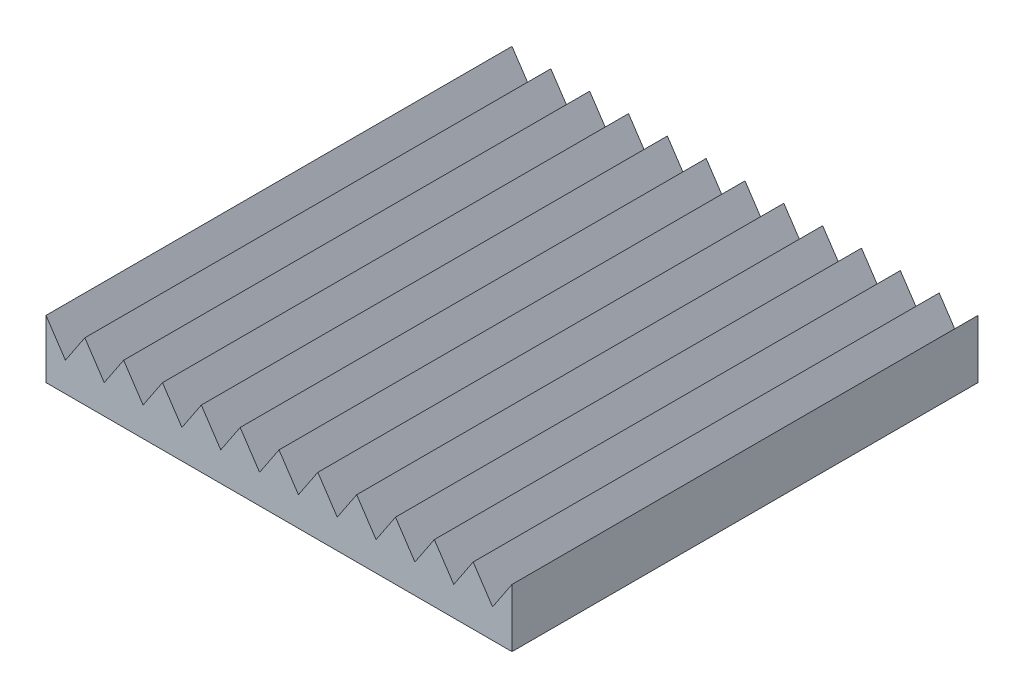
ISO-10303-21;
HEADER;
FILE_DESCRIPTION(('STEP AP214'),'2;1');
FILE_NAME('part.step','',(''),(''),'','','');
FILE_SCHEMA(('AUTOMOTIVE_DESIGN { 1 0 10303 214 1 1 1 1 }'));
ENDSEC;
DATA;
#1=APPLICATION_CONTEXT('core data for automotive mechanical design processes');
#2=APPLICATION_PROTOCOL_DEFINITION('international standard','automotive_design',2000,#1);
#3=PRODUCT_CONTEXT('',#1,'mechanical');
#4=PRODUCT('Part','Part','',(#3));
#5=PRODUCT_RELATED_PRODUCT_CATEGORY('part','',(#4));
#6=PRODUCT_DEFINITION_FORMATION('','',#4);
#7=PRODUCT_DEFINITION_CONTEXT('part definition',#1,'design');
#8=PRODUCT_DEFINITION('design','',#6,#7);
#9=PRODUCT_DEFINITION_SHAPE('','',#8);
#10=(LENGTH_UNIT() NAMED_UNIT(*) SI_UNIT(.MILLI.,.METRE.));
#11=(NAMED_UNIT(*) PLANE_ANGLE_UNIT() SI_UNIT($,.RADIAN.));
#12=(NAMED_UNIT(*) SI_UNIT($,.STERADIAN.) SOLID_ANGLE_UNIT());
#13=UNCERTAINTY_MEASURE_WITH_UNIT(LENGTH_MEASURE(1.E-05),#10,'distance_accuracy_value','');
#14=(GEOMETRIC_REPRESENTATION_CONTEXT(3) GLOBAL_UNCERTAINTY_ASSIGNED_CONTEXT((#13)) GLOBAL_UNIT_ASSIGNED_CONTEXT((#10,
#11,#12)) REPRESENTATION_CONTEXT('',''));
#15=CARTESIAN_POINT('',(0.,0.,0.));
#16=DIRECTION('',(0.,0.,1.));
#17=DIRECTION('',(1.,0.,0.));
#18=AXIS2_PLACEMENT_3D('',#15,#16,#17);
#19=CARTESIAN_POINT('',(0.,38.1,0.));
#20=DIRECTION('',(1.,0.,0.));
#21=DIRECTION('',(0.,0.,-1.));
#22=AXIS2_PLACEMENT_3D('',#19,#20,#21);
#23=PLANE('',#22);
#24=DIRECTION('',(0.,0.,1.));
#25=VECTOR('',#24,1.);
#26=CARTESIAN_POINT('',(0.,0.,0.));
#27=LINE('',#26,#25);
#28=CARTESIAN_POINT('',(0.,0.,0.));
#29=VERTEX_POINT('',#28);
#30=CARTESIAN_POINT('',(0.,0.,304.8));
#31=VERTEX_POINT('',#30);
#32=EDGE_CURVE('E92',#29,#31,#27,.T.);
#33=ORIENTED_EDGE('',*,*,#32,.T.);
#34=DIRECTION('',(0.,-1.,0.));
#35=VECTOR('',#34,1.);
#36=CARTESIAN_POINT('',(0.,38.1,304.8));
#37=LINE('',#36,#35);
#38=CARTESIAN_POINT('',(0.,38.1,304.8));
#39=VERTEX_POINT('',#38);
#40=EDGE_CURVE('E11',#39,#31,#37,.T.);
#41=ORIENTED_EDGE('',*,*,#40,.F.);
#42=DIRECTION('',(0.,0.,1.));
#43=VECTOR('',#42,1.);
#44=CARTESIAN_POINT('',(0.,38.1,0.));
#45=LINE('',#44,#43);
#46=CARTESIAN_POINT('',(0.,38.1,0.));
#47=VERTEX_POINT('',#46);
#48=EDGE_CURVE('E93',#47,#39,#45,.T.);
#49=ORIENTED_EDGE('',*,*,#48,.F.);
#50=DIRECTION('',(0.,-1.,0.));
#51=VECTOR('',#50,1.);
#52=CARTESIAN_POINT('',(0.,38.1,0.));
#53=LINE('',#52,#51);
#54=EDGE_CURVE('E87',#47,#29,#53,.T.);
#55=ORIENTED_EDGE('',*,*,#54,.T.);
#56=EDGE_LOOP('',(#33,#41,#49,#55));
#57=FACE_BOUND('',#56,.T.);
#58=ADVANCED_FACE('F33',(#57),#23,.F.);
#59=CARTESIAN_POINT('',(0.,38.1,304.8));
#60=DIRECTION('',(0.,0.,-1.));
#61=DIRECTION('',(-1.,0.,0.));
#62=AXIS2_PLACEMENT_3D('',#59,#60,#61);
#63=PLANE('',#62);
#64=DIRECTION('',(0.554700196225229,-0.832050294337844,0.));
#65=VECTOR('',#64,1.);
#66=CARTESIAN_POINT('',(279.4,38.1,304.8));
#67=LINE('',#66,#65);
#68=CARTESIAN_POINT('',(279.4,38.1,304.8));
#69=VERTEX_POINT('',#68);
#70=CARTESIAN_POINT('',(292.1,19.05,304.8));
#71=VERTEX_POINT('',#70);
#72=EDGE_CURVE('E254',#69,#71,#67,.T.);
#73=ORIENTED_EDGE('',*,*,#72,.F.);
#74=DIRECTION('',(0.554700196225229,0.832050294337844,0.));
#75=VECTOR('',#74,1.);
#76=CARTESIAN_POINT('',(266.7,19.05,304.8));
#77=LINE('',#76,#75);
#78=CARTESIAN_POINT('',(266.7,19.05,304.8));
#79=VERTEX_POINT('',#78);
#80=EDGE_CURVE('E234',#79,#69,#77,.T.);
#81=ORIENTED_EDGE('',*,*,#80,.F.);
#82=DIRECTION('',(0.554700196225229,-0.832050294337844,0.));
#83=VECTOR('',#82,1.);
#84=CARTESIAN_POINT('',(254.,38.1,304.8));
#85=LINE('',#84,#83);
#86=CARTESIAN_POINT('',(254.,38.1,304.8));
#87=VERTEX_POINT('',#86);
#88=EDGE_CURVE('E248',#87,#79,#85,.T.);
#89=ORIENTED_EDGE('',*,*,#88,.F.);
#90=DIRECTION('',(0.554700196225229,0.832050294337844,0.));
#91=VECTOR('',#90,1.);
#92=CARTESIAN_POINT('',(241.3,19.05,304.8));
#93=LINE('',#92,#91);
#94=CARTESIAN_POINT('',(241.3,19.05,304.8));
#95=VERTEX_POINT('',#94);
#96=EDGE_CURVE('E370',#95,#87,#93,.T.);
#97=ORIENTED_EDGE('',*,*,#96,.F.);
#98=DIRECTION('',(0.554700196225229,-0.832050294337844,0.));
#99=VECTOR('',#98,1.);
#100=CARTESIAN_POINT('',(228.6,38.1,304.8));
#101=LINE('',#100,#99);
#102=CARTESIAN_POINT('',(228.6,38.1,304.8));
#103=VERTEX_POINT('',#102);
#104=EDGE_CURVE('E271',#103,#95,#101,.T.);
#105=ORIENTED_EDGE('',*,*,#104,.F.);
#106=DIRECTION('',(0.554700196225229,0.832050294337844,0.));
#107=VECTOR('',#106,1.);
#108=CARTESIAN_POINT('',(215.9,19.05,304.8));
#109=LINE('',#108,#107);
#110=CARTESIAN_POINT('',(215.9,19.05,304.8));
#111=VERTEX_POINT('',#110);
#112=EDGE_CURVE('E568',#111,#103,#109,.T.);
#113=ORIENTED_EDGE('',*,*,#112,.F.);
#114=DIRECTION('',(0.554700196225229,-0.832050294337844,0.));
#115=VECTOR('',#114,1.);
#116=CARTESIAN_POINT('',(203.2,38.1,304.8));
#117=LINE('',#116,#115);
#118=CARTESIAN_POINT('',(203.2,38.1,304.8));
#119=VERTEX_POINT('',#118);
#120=EDGE_CURVE('E256',#119,#111,#117,.T.);
#121=ORIENTED_EDGE('',*,*,#120,.F.);
#122=DIRECTION('',(0.554700196225229,0.832050294337844,0.));
#123=VECTOR('',#122,1.);
#124=CARTESIAN_POINT('',(190.5,19.05,304.8));
#125=LINE('',#124,#123);
#126=CARTESIAN_POINT('',(190.5,19.05,304.8));
#127=VERTEX_POINT('',#126);
#128=EDGE_CURVE('E352',#127,#119,#125,.T.);
#129=ORIENTED_EDGE('',*,*,#128,.F.);
#130=DIRECTION('',(0.554700196225229,-0.832050294337844,0.));
#131=VECTOR('',#130,1.);
#132=CARTESIAN_POINT('',(177.8,38.1,304.8));
#133=LINE('',#132,#131);
#134=CARTESIAN_POINT('',(177.8,38.1,304.8));
#135=VERTEX_POINT('',#134);
#136=EDGE_CURVE('E356',#135,#127,#133,.T.);
#137=ORIENTED_EDGE('',*,*,#136,.F.);
#138=DIRECTION('',(0.554700196225229,0.832050294337844,0.));
#139=VECTOR('',#138,1.);
#140=CARTESIAN_POINT('',(165.1,19.05,304.8));
#141=LINE('',#140,#139);
#142=CARTESIAN_POINT('',(165.1,19.05,304.8));
#143=VERTEX_POINT('',#142);
#144=EDGE_CURVE('E555',#143,#135,#141,.T.);
#145=ORIENTED_EDGE('',*,*,#144,.F.);
#146=DIRECTION('',(0.554700196225229,-0.832050294337844,0.));
#147=VECTOR('',#146,1.);
#148=CARTESIAN_POINT('',(152.4,38.1,304.8));
#149=LINE('',#148,#147);
#150=CARTESIAN_POINT('',(152.4,38.1,304.8));
#151=VERTEX_POINT('',#150);
#152=EDGE_CURVE('E552',#151,#143,#149,.T.);
#153=ORIENTED_EDGE('',*,*,#152,.F.);
#154=DIRECTION('',(0.554700196225229,0.832050294337844,0.));
#155=VECTOR('',#154,1.);
#156=CARTESIAN_POINT('',(139.7,19.05,304.8));
#157=LINE('',#156,#155);
#158=CARTESIAN_POINT('',(139.7,19.05,304.8));
#159=VERTEX_POINT('',#158);
#160=EDGE_CURVE('E334',#159,#151,#157,.T.);
#161=ORIENTED_EDGE('',*,*,#160,.F.);
#162=DIRECTION('',(0.554700196225229,-0.832050294337844,0.));
#163=VECTOR('',#162,1.);
#164=CARTESIAN_POINT('',(127.,38.1,304.8));
#165=LINE('',#164,#163);
#166=CARTESIAN_POINT('',(127.,38.1,304.8));
#167=VERTEX_POINT('',#166);
#168=EDGE_CURVE('E338',#167,#159,#165,.T.);
#169=ORIENTED_EDGE('',*,*,#168,.F.);
#170=DIRECTION('',(0.554700196225229,0.832050294337844,0.));
#171=VECTOR('',#170,1.);
#172=CARTESIAN_POINT('',(114.3,19.05,304.8));
#173=LINE('',#172,#171);
#174=CARTESIAN_POINT('',(114.3,19.05,304.8));
#175=VERTEX_POINT('',#174);
#176=EDGE_CURVE('E526',#175,#167,#173,.T.);
#177=ORIENTED_EDGE('',*,*,#176,.F.);
#178=DIRECTION('',(0.554700196225229,-0.832050294337844,0.));
#179=VECTOR('',#178,1.);
#180=CARTESIAN_POINT('',(101.6,38.1,304.8));
#181=LINE('',#180,#179);
#182=CARTESIAN_POINT('',(101.6,38.1,304.8));
#183=VERTEX_POINT('',#182);
#184=EDGE_CURVE('E530',#183,#175,#181,.T.);
#185=ORIENTED_EDGE('',*,*,#184,.F.);
#186=DIRECTION('',(0.554700196225229,0.832050294337844,0.));
#187=VECTOR('',#186,1.);
#188=CARTESIAN_POINT('',(88.9,19.05,304.8));
#189=LINE('',#188,#187);
#190=CARTESIAN_POINT('',(88.9,19.05,304.8));
#191=VERTEX_POINT('',#190);
#192=EDGE_CURVE('E319',#191,#183,#189,.T.);
#193=ORIENTED_EDGE('',*,*,#192,.F.);
#194=DIRECTION('',(0.554700196225229,-0.832050294337844,0.));
#195=VECTOR('',#194,1.);
#196=CARTESIAN_POINT('',(76.2,38.1,304.8));
#197=LINE('',#196,#195);
#198=CARTESIAN_POINT('',(76.2,38.1,304.8));
#199=VERTEX_POINT('',#198);
#200=EDGE_CURVE('E322',#199,#191,#197,.T.);
#201=ORIENTED_EDGE('',*,*,#200,.F.);
#202=DIRECTION('',(0.554700196225229,0.832050294337844,0.));
#203=VECTOR('',#202,1.);
#204=CARTESIAN_POINT('',(63.5,19.05,304.8));
#205=LINE('',#204,#203);
#206=CARTESIAN_POINT('',(63.5,19.05,304.8));
#207=VERTEX_POINT('',#206);
#208=EDGE_CURVE('E501',#207,#199,#205,.T.);
#209=ORIENTED_EDGE('',*,*,#208,.F.);
#210=DIRECTION('',(0.554700196225229,-0.832050294337844,0.));
#211=VECTOR('',#210,1.);
#212=CARTESIAN_POINT('',(50.8,38.1,304.8));
#213=LINE('',#212,#211);
#214=CARTESIAN_POINT('',(50.8,38.1,304.8));
#215=VERTEX_POINT('',#214);
#216=EDGE_CURVE('E506',#215,#207,#213,.T.);
#217=ORIENTED_EDGE('',*,*,#216,.F.);
#218=DIRECTION('',(0.554700196225229,0.832050294337844,0.));
#219=VECTOR('',#218,1.);
#220=CARTESIAN_POINT('',(38.1,19.05,304.8));
#221=LINE('',#220,#219);
#222=CARTESIAN_POINT('',(38.1,19.05,304.8));
#223=VERTEX_POINT('',#222);
#224=EDGE_CURVE('E295',#223,#215,#221,.T.);
#225=ORIENTED_EDGE('',*,*,#224,.F.);
#226=DIRECTION('',(0.554700196225229,-0.832050294337844,0.));
#227=VECTOR('',#226,1.);
#228=CARTESIAN_POINT('',(25.4,38.1,304.8));
#229=LINE('',#228,#227);
#230=CARTESIAN_POINT('',(25.4,38.1,304.8));
#231=VERTEX_POINT('',#230);
#232=EDGE_CURVE('E291',#231,#223,#229,.T.);
#233=ORIENTED_EDGE('',*,*,#232,.F.);
#234=DIRECTION('',(0.554700196225229,0.832050294337844,0.));
#235=VECTOR('',#234,1.);
#236=CARTESIAN_POINT('',(12.7,19.05,304.8));
#237=LINE('',#236,#235);
#238=CARTESIAN_POINT('',(12.7,19.05,304.8));
#239=VERTEX_POINT('',#238);
#240=EDGE_CURVE('E274',#239,#231,#237,.T.);
#241=ORIENTED_EDGE('',*,*,#240,.F.);
#242=DIRECTION('',(0.554700196225229,-0.832050294337844,0.));
#243=VECTOR('',#242,1.);
#244=CARTESIAN_POINT('',(0.,38.1,304.8));
#245=LINE('',#244,#243);
#246=EDGE_CURVE('E118',#39,#239,#245,.T.);
#247=ORIENTED_EDGE('',*,*,#246,.F.);
#248=ORIENTED_EDGE('',*,*,#40,.T.);
#249=DIRECTION('',(1.,0.,0.));
#250=VECTOR('',#249,1.);
#251=CARTESIAN_POINT('',(0.,0.,304.8));
#252=LINE('',#251,#250);
#253=CARTESIAN_POINT('',(304.8,0.,304.8));
#254=VERTEX_POINT('',#253);
#255=EDGE_CURVE('E77',#31,#254,#252,.T.);
#256=ORIENTED_EDGE('',*,*,#255,.T.);
#257=DIRECTION('',(0.,-1.,0.));
#258=VECTOR('',#257,1.);
#259=CARTESIAN_POINT('',(304.8,38.1,304.8));
#260=LINE('',#259,#258);
#261=CARTESIAN_POINT('',(304.8,38.1,304.8));
#262=VERTEX_POINT('',#261);
#263=EDGE_CURVE('E41',#262,#254,#260,.T.);
#264=ORIENTED_EDGE('',*,*,#263,.F.);
#265=DIRECTION('',(0.554700196225229,0.832050294337844,0.));
#266=VECTOR('',#265,1.);
#267=CARTESIAN_POINT('',(292.1,19.05,304.8));
#268=LINE('',#267,#266);
#269=EDGE_CURVE('E258',#71,#262,#268,.T.);
#270=ORIENTED_EDGE('',*,*,#269,.F.);
#271=EDGE_LOOP('',(#73,#81,#89,#97,#105,#113,#121,#129,#137,#145,#153,#161,#169,#177,#185,#193,
#201,#209,#217,#225,#233,#241,#247,#248,#256,#264,#270));
#272=FACE_BOUND('',#271,.T.);
#273=ADVANCED_FACE('F110',(#272),#63,.F.);
#274=CARTESIAN_POINT('',(304.8,38.1,0.));
#275=DIRECTION('',(-1.,0.,0.));
#276=DIRECTION('',(0.,0.,1.));
#277=AXIS2_PLACEMENT_3D('',#274,#275,#276);
#278=PLANE('',#277);
#279=DIRECTION('',(0.,0.,-1.));
#280=VECTOR('',#279,1.);
#281=CARTESIAN_POINT('',(304.8,0.,0.));
#282=LINE('',#281,#280);
#283=CARTESIAN_POINT('',(304.8,0.,0.));
#284=VERTEX_POINT('',#283);
#285=EDGE_CURVE('E67',#254,#284,#282,.T.);
#286=ORIENTED_EDGE('',*,*,#285,.T.);
#287=DIRECTION('',(0.,-1.,0.));
#288=VECTOR('',#287,1.);
#289=CARTESIAN_POINT('',(304.8,38.1,0.));
#290=LINE('',#289,#288);
#291=CARTESIAN_POINT('',(304.8,38.1,0.));
#292=VERTEX_POINT('',#291);
#293=EDGE_CURVE('E72',#292,#284,#290,.T.);
#294=ORIENTED_EDGE('',*,*,#293,.F.);
#295=DIRECTION('',(0.,0.,-1.));
#296=VECTOR('',#295,1.);
#297=CARTESIAN_POINT('',(304.8,38.1,0.));
#298=LINE('',#297,#296);
#299=EDGE_CURVE('E95',#262,#292,#298,.T.);
#300=ORIENTED_EDGE('',*,*,#299,.F.);
#301=ORIENTED_EDGE('',*,*,#263,.T.);
#302=EDGE_LOOP('',(#286,#294,#300,#301));
#303=FACE_BOUND('',#302,.T.);
#304=ADVANCED_FACE('F69',(#303),#278,.F.);
#305=CARTESIAN_POINT('',(0.,38.1,0.));
#306=DIRECTION('',(0.,0.,1.));
#307=DIRECTION('',(1.,0.,0.));
#308=AXIS2_PLACEMENT_3D('',#305,#306,#307);
#309=PLANE('',#308);
#310=DIRECTION('',(0.554700196225229,-0.832050294337844,0.));
#311=VECTOR('',#310,1.);
#312=CARTESIAN_POINT('',(254.,38.1,0.));
#313=LINE('',#312,#311);
#314=CARTESIAN_POINT('',(254.,38.1,0.));
#315=VERTEX_POINT('',#314);
#316=CARTESIAN_POINT('',(266.7,19.05,0.));
#317=VERTEX_POINT('',#316);
#318=EDGE_CURVE('E247',#315,#317,#313,.T.);
#319=ORIENTED_EDGE('',*,*,#318,.T.);
#320=DIRECTION('',(0.554700196225229,0.832050294337844,0.));
#321=VECTOR('',#320,1.);
#322=CARTESIAN_POINT('',(266.7,19.05,0.));
#323=LINE('',#322,#321);
#324=CARTESIAN_POINT('',(279.4,38.1,0.));
#325=VERTEX_POINT('',#324);
#326=EDGE_CURVE('E382',#317,#325,#323,.T.);
#327=ORIENTED_EDGE('',*,*,#326,.T.);
#328=DIRECTION('',(0.554700196225229,-0.832050294337844,0.));
#329=VECTOR('',#328,1.);
#330=CARTESIAN_POINT('',(279.4,38.1,0.));
#331=LINE('',#330,#329);
#332=CARTESIAN_POINT('',(292.1,19.05,0.));
#333=VERTEX_POINT('',#332);
#334=EDGE_CURVE('E255',#325,#333,#331,.T.);
#335=ORIENTED_EDGE('',*,*,#334,.T.);
#336=DIRECTION('',(0.554700196225229,0.832050294337844,0.));
#337=VECTOR('',#336,1.);
#338=CARTESIAN_POINT('',(292.1,19.05,0.));
#339=LINE('',#338,#337);
#340=EDGE_CURVE('E86',#333,#292,#339,.T.);
#341=ORIENTED_EDGE('',*,*,#340,.T.);
#342=ORIENTED_EDGE('',*,*,#293,.T.);
#343=DIRECTION('',(-1.,0.,0.));
#344=VECTOR('',#343,1.);
#345=CARTESIAN_POINT('',(0.,0.,0.));
#346=LINE('',#345,#344);
#347=EDGE_CURVE('E76',#284,#29,#346,.T.);
#348=ORIENTED_EDGE('',*,*,#347,.T.);
#349=ORIENTED_EDGE('',*,*,#54,.F.);
#350=DIRECTION('',(0.554700196225229,-0.832050294337844,0.));
#351=VECTOR('',#350,1.);
#352=CARTESIAN_POINT('',(0.,38.1,0.));
#353=LINE('',#352,#351);
#354=CARTESIAN_POINT('',(12.7,19.05,0.));
#355=VERTEX_POINT('',#354);
#356=EDGE_CURVE('E48',#47,#355,#353,.T.);
#357=ORIENTED_EDGE('',*,*,#356,.T.);
#358=DIRECTION('',(0.554700196225229,0.832050294337844,0.));
#359=VECTOR('',#358,1.);
#360=CARTESIAN_POINT('',(12.7,19.05,0.));
#361=LINE('',#360,#359);
#362=CARTESIAN_POINT('',(25.4,38.1,0.));
#363=VERTEX_POINT('',#362);
#364=EDGE_CURVE('E273',#355,#363,#361,.T.);
#365=ORIENTED_EDGE('',*,*,#364,.T.);
#366=DIRECTION('',(0.554700196225229,-0.832050294337844,0.));
#367=VECTOR('',#366,1.);
#368=CARTESIAN_POINT('',(25.4,38.1,0.));
#369=LINE('',#368,#367);
#370=CARTESIAN_POINT('',(38.1,19.05,0.));
#371=VERTEX_POINT('',#370);
#372=EDGE_CURVE('E301',#363,#371,#369,.T.);
#373=ORIENTED_EDGE('',*,*,#372,.T.);
#374=DIRECTION('',(0.554700196225229,0.832050294337844,0.));
#375=VECTOR('',#374,1.);
#376=CARTESIAN_POINT('',(38.1,19.05,0.));
#377=LINE('',#376,#375);
#378=CARTESIAN_POINT('',(50.8,38.1,0.));
#379=VERTEX_POINT('',#378);
#380=EDGE_CURVE('E307',#371,#379,#377,.T.);
#381=ORIENTED_EDGE('',*,*,#380,.T.);
#382=DIRECTION('',(0.554700196225229,-0.832050294337844,0.));
#383=VECTOR('',#382,1.);
#384=CARTESIAN_POINT('',(50.8,38.1,0.));
#385=LINE('',#384,#383);
#386=CARTESIAN_POINT('',(63.5,19.05,0.));
#387=VERTEX_POINT('',#386);
#388=EDGE_CURVE('E511',#379,#387,#385,.T.);
#389=ORIENTED_EDGE('',*,*,#388,.T.);
#390=DIRECTION('',(0.554700196225229,0.832050294337844,0.));
#391=VECTOR('',#390,1.);
#392=CARTESIAN_POINT('',(63.5,19.05,0.));
#393=LINE('',#392,#391);
#394=CARTESIAN_POINT('',(76.2,38.1,0.));
#395=VERTEX_POINT('',#394);
#396=EDGE_CURVE('E503',#387,#395,#393,.T.);
#397=ORIENTED_EDGE('',*,*,#396,.T.);
#398=DIRECTION('',(0.554700196225229,-0.832050294337844,0.));
#399=VECTOR('',#398,1.);
#400=CARTESIAN_POINT('',(76.2,38.1,0.));
#401=LINE('',#400,#399);
#402=CARTESIAN_POINT('',(88.9,19.05,0.));
#403=VERTEX_POINT('',#402);
#404=EDGE_CURVE('E315',#395,#403,#401,.T.);
#405=ORIENTED_EDGE('',*,*,#404,.T.);
#406=DIRECTION('',(0.554700196225229,0.832050294337844,0.));
#407=VECTOR('',#406,1.);
#408=CARTESIAN_POINT('',(88.9,19.05,0.));
#409=LINE('',#408,#407);
#410=CARTESIAN_POINT('',(101.6,38.1,0.));
#411=VERTEX_POINT('',#410);
#412=EDGE_CURVE('E318',#403,#411,#409,.T.);
#413=ORIENTED_EDGE('',*,*,#412,.T.);
#414=DIRECTION('',(0.554700196225229,-0.832050294337844,0.));
#415=VECTOR('',#414,1.);
#416=CARTESIAN_POINT('',(101.6,38.1,0.));
#417=LINE('',#416,#415);
#418=CARTESIAN_POINT('',(114.3,19.05,0.));
#419=VERTEX_POINT('',#418);
#420=EDGE_CURVE('E522',#411,#419,#417,.T.);
#421=ORIENTED_EDGE('',*,*,#420,.T.);
#422=DIRECTION('',(0.554700196225229,0.832050294337844,0.));
#423=VECTOR('',#422,1.);
#424=CARTESIAN_POINT('',(114.3,19.05,0.));
#425=LINE('',#424,#423);
#426=CARTESIAN_POINT('',(127.,38.1,0.));
#427=VERTEX_POINT('',#426);
#428=EDGE_CURVE('E524',#419,#427,#425,.T.);
#429=ORIENTED_EDGE('',*,*,#428,.T.);
#430=DIRECTION('',(0.554700196225229,-0.832050294337844,0.));
#431=VECTOR('',#430,1.);
#432=CARTESIAN_POINT('',(127.,38.1,0.));
#433=LINE('',#432,#431);
#434=CARTESIAN_POINT('',(139.7,19.05,0.));
#435=VERTEX_POINT('',#434);
#436=EDGE_CURVE('E330',#427,#435,#433,.T.);
#437=ORIENTED_EDGE('',*,*,#436,.T.);
#438=DIRECTION('',(0.554700196225229,0.832050294337844,0.));
#439=VECTOR('',#438,1.);
#440=CARTESIAN_POINT('',(139.7,19.05,0.));
#441=LINE('',#440,#439);
#442=CARTESIAN_POINT('',(152.4,38.1,0.));
#443=VERTEX_POINT('',#442);
#444=EDGE_CURVE('E333',#435,#443,#441,.T.);
#445=ORIENTED_EDGE('',*,*,#444,.T.);
#446=DIRECTION('',(0.554700196225229,-0.832050294337844,0.));
#447=VECTOR('',#446,1.);
#448=CARTESIAN_POINT('',(152.4,38.1,0.));
#449=LINE('',#448,#447);
#450=CARTESIAN_POINT('',(165.1,19.05,0.));
#451=VERTEX_POINT('',#450);
#452=EDGE_CURVE('E549',#443,#451,#449,.T.);
#453=ORIENTED_EDGE('',*,*,#452,.T.);
#454=DIRECTION('',(0.554700196225229,0.832050294337844,0.));
#455=VECTOR('',#454,1.);
#456=CARTESIAN_POINT('',(165.1,19.05,0.));
#457=LINE('',#456,#455);
#458=CARTESIAN_POINT('',(177.8,38.1,0.));
#459=VERTEX_POINT('',#458);
#460=EDGE_CURVE('E561',#451,#459,#457,.T.);
#461=ORIENTED_EDGE('',*,*,#460,.T.);
#462=DIRECTION('',(0.554700196225229,-0.832050294337844,0.));
#463=VECTOR('',#462,1.);
#464=CARTESIAN_POINT('',(177.8,38.1,0.));
#465=LINE('',#464,#463);
#466=CARTESIAN_POINT('',(190.5,19.05,0.));
#467=VERTEX_POINT('',#466);
#468=EDGE_CURVE('E348',#459,#467,#465,.T.);
#469=ORIENTED_EDGE('',*,*,#468,.T.);
#470=DIRECTION('',(0.554700196225229,0.832050294337844,0.));
#471=VECTOR('',#470,1.);
#472=CARTESIAN_POINT('',(190.5,19.05,0.));
#473=LINE('',#472,#471);
#474=CARTESIAN_POINT('',(203.2,38.1,0.));
#475=VERTEX_POINT('',#474);
#476=EDGE_CURVE('E351',#467,#475,#473,.T.);
#477=ORIENTED_EDGE('',*,*,#476,.T.);
#478=DIRECTION('',(0.554700196225229,-0.832050294337844,0.));
#479=VECTOR('',#478,1.);
#480=CARTESIAN_POINT('',(203.2,38.1,0.));
#481=LINE('',#480,#479);
#482=CARTESIAN_POINT('',(215.9,19.05,0.));
#483=VERTEX_POINT('',#482);
#484=EDGE_CURVE('E570',#475,#483,#481,.T.);
#485=ORIENTED_EDGE('',*,*,#484,.T.);
#486=DIRECTION('',(0.554700196225229,0.832050294337844,0.));
#487=VECTOR('',#486,1.);
#488=CARTESIAN_POINT('',(215.9,19.05,0.));
#489=LINE('',#488,#487);
#490=CARTESIAN_POINT('',(228.6,38.1,0.));
#491=VERTEX_POINT('',#490);
#492=EDGE_CURVE('E442',#483,#491,#489,.T.);
#493=ORIENTED_EDGE('',*,*,#492,.T.);
#494=DIRECTION('',(0.554700196225229,-0.832050294337844,0.));
#495=VECTOR('',#494,1.);
#496=CARTESIAN_POINT('',(228.6,38.1,0.));
#497=LINE('',#496,#495);
#498=CARTESIAN_POINT('',(241.3,19.05,0.));
#499=VERTEX_POINT('',#498);
#500=EDGE_CURVE('E366',#491,#499,#497,.T.);
#501=ORIENTED_EDGE('',*,*,#500,.T.);
#502=DIRECTION('',(0.554700196225229,0.832050294337844,0.));
#503=VECTOR('',#502,1.);
#504=CARTESIAN_POINT('',(241.3,19.05,0.));
#505=LINE('',#504,#503);
#506=EDGE_CURVE('E369',#499,#315,#505,.T.);
#507=ORIENTED_EDGE('',*,*,#506,.T.);
#508=EDGE_LOOP('',(#319,#327,#335,#341,#342,#348,#349,#357,#365,#373,#381,#389,#397,#405,#413,
#421,#429,#437,#445,#453,#461,#469,#477,#485,#493,#501,#507));
#509=FACE_BOUND('',#508,.T.);
#510=ADVANCED_FACE('F82',(#509),#309,.F.);
#511=CARTESIAN_POINT('',(0.,0.,0.));
#512=DIRECTION('',(0.,1.,0.));
#513=DIRECTION('',(0.,0.,1.));
#514=AXIS2_PLACEMENT_3D('',#511,#512,#513);
#515=PLANE('',#514);
#516=ORIENTED_EDGE('',*,*,#32,.F.);
#517=ORIENTED_EDGE('',*,*,#347,.F.);
#518=ORIENTED_EDGE('',*,*,#285,.F.);
#519=ORIENTED_EDGE('',*,*,#255,.F.);
#520=EDGE_LOOP('',(#516,#517,#518,#519));
#521=FACE_BOUND('',#520,.T.);
#522=ADVANCED_FACE('F90',(#521),#515,.F.);
#523=CARTESIAN_POINT('',(12.7,19.05,0.));
#524=DIRECTION('',(0.832050294337844,-0.554700196225229,0.));
#525=DIRECTION('',(0.554700196225229,0.832050294337844,0.));
#526=AXIS2_PLACEMENT_3D('',#523,#524,#525);
#527=PLANE('',#526);
#528=ORIENTED_EDGE('',*,*,#240,.T.);
#529=DIRECTION('',(0.,0.,1.));
#530=VECTOR('',#529,1.);
#531=CARTESIAN_POINT('',(25.4,38.1,0.));
#532=LINE('',#531,#530);
#533=EDGE_CURVE('E107',#363,#231,#532,.T.);
#534=ORIENTED_EDGE('',*,*,#533,.F.);
#535=ORIENTED_EDGE('',*,*,#364,.F.);
#536=DIRECTION('',(0.,0.,1.));
#537=VECTOR('',#536,1.);
#538=CARTESIAN_POINT('',(12.7,19.05,0.));
#539=LINE('',#538,#537);
#540=EDGE_CURVE('E277',#355,#239,#539,.T.);
#541=ORIENTED_EDGE('',*,*,#540,.T.);
#542=EDGE_LOOP('',(#528,#534,#535,#541));
#543=FACE_BOUND('',#542,.T.);
#544=ADVANCED_FACE('F134',(#543),#527,.F.);
#545=CARTESIAN_POINT('',(0.,38.1,0.));
#546=DIRECTION('',(-0.832050294337844,-0.554700196225229,0.));
#547=DIRECTION('',(0.554700196225229,-0.832050294337844,0.));
#548=AXIS2_PLACEMENT_3D('',#545,#546,#547);
#549=PLANE('',#548);
#550=ORIENTED_EDGE('',*,*,#246,.T.);
#551=ORIENTED_EDGE('',*,*,#540,.F.);
#552=ORIENTED_EDGE('',*,*,#356,.F.);
#553=ORIENTED_EDGE('',*,*,#48,.T.);
#554=EDGE_LOOP('',(#550,#551,#552,#553));
#555=FACE_BOUND('',#554,.T.);
#556=ADVANCED_FACE('F135',(#555),#549,.F.);
#557=CARTESIAN_POINT('',(38.1,19.05,0.));
#558=DIRECTION('',(0.832050294337844,-0.554700196225229,0.));
#559=DIRECTION('',(0.554700196225229,0.832050294337844,0.));
#560=AXIS2_PLACEMENT_3D('',#557,#558,#559);
#561=PLANE('',#560);
#562=ORIENTED_EDGE('',*,*,#224,.T.);
#563=DIRECTION('',(0.,0.,1.));
#564=VECTOR('',#563,1.);
#565=CARTESIAN_POINT('',(50.8,38.1,0.));
#566=LINE('',#565,#564);
#567=EDGE_CURVE('E279',#379,#215,#566,.T.);
#568=ORIENTED_EDGE('',*,*,#567,.F.);
#569=ORIENTED_EDGE('',*,*,#380,.F.);
#570=DIRECTION('',(0.,0.,1.));
#571=VECTOR('',#570,1.);
#572=CARTESIAN_POINT('',(38.1,19.05,0.));
#573=LINE('',#572,#571);
#574=EDGE_CURVE('E312',#371,#223,#573,.T.);
#575=ORIENTED_EDGE('',*,*,#574,.T.);
#576=EDGE_LOOP('',(#562,#568,#569,#575));
#577=FACE_BOUND('',#576,.T.);
#578=ADVANCED_FACE('F138',(#577),#561,.F.);
#579=CARTESIAN_POINT('',(25.4,38.1,0.));
#580=DIRECTION('',(-0.832050294337844,-0.554700196225229,0.));
#581=DIRECTION('',(0.554700196225229,-0.832050294337844,0.));
#582=AXIS2_PLACEMENT_3D('',#579,#580,#581);
#583=PLANE('',#582);
#584=ORIENTED_EDGE('',*,*,#232,.T.);
#585=ORIENTED_EDGE('',*,*,#574,.F.);
#586=ORIENTED_EDGE('',*,*,#372,.F.);
#587=ORIENTED_EDGE('',*,*,#533,.T.);
#588=EDGE_LOOP('',(#584,#585,#586,#587));
#589=FACE_BOUND('',#588,.T.);
#590=ADVANCED_FACE('F150',(#589),#583,.F.);
#591=CARTESIAN_POINT('',(292.1,19.05,0.));
#592=DIRECTION('',(0.832050294337844,-0.554700196225229,0.));
#593=DIRECTION('',(0.554700196225229,0.832050294337844,0.));
#594=AXIS2_PLACEMENT_3D('',#591,#592,#593);
#595=PLANE('',#594);
#596=ORIENTED_EDGE('',*,*,#269,.T.);
#597=ORIENTED_EDGE('',*,*,#299,.T.);
#598=ORIENTED_EDGE('',*,*,#340,.F.);
#599=DIRECTION('',(0.,0.,1.));
#600=VECTOR('',#599,1.);
#601=CARTESIAN_POINT('',(292.1,19.05,0.));
#602=LINE('',#601,#600);
#603=EDGE_CURVE('E268',#333,#71,#602,.T.);
#604=ORIENTED_EDGE('',*,*,#603,.T.);
#605=EDGE_LOOP('',(#596,#597,#598,#604));
#606=FACE_BOUND('',#605,.T.);
#607=ADVANCED_FACE('F146',(#606),#595,.F.);
#608=CARTESIAN_POINT('',(279.4,38.1,0.));
#609=DIRECTION('',(-0.832050294337844,-0.554700196225229,0.));
#610=DIRECTION('',(0.554700196225229,-0.832050294337844,0.));
#611=AXIS2_PLACEMENT_3D('',#608,#609,#610);
#612=PLANE('',#611);
#613=ORIENTED_EDGE('',*,*,#72,.T.);
#614=ORIENTED_EDGE('',*,*,#603,.F.);
#615=ORIENTED_EDGE('',*,*,#334,.F.);
#616=DIRECTION('',(0.,0.,1.));
#617=VECTOR('',#616,1.);
#618=CARTESIAN_POINT('',(279.4,38.1,0.));
#619=LINE('',#618,#617);
#620=EDGE_CURVE('E238',#325,#69,#619,.T.);
#621=ORIENTED_EDGE('',*,*,#620,.T.);
#622=EDGE_LOOP('',(#613,#614,#615,#621));
#623=FACE_BOUND('',#622,.T.);
#624=ADVANCED_FACE('F142',(#623),#612,.F.);
#625=CARTESIAN_POINT('',(241.3,19.05,0.));
#626=DIRECTION('',(0.832050294337844,-0.554700196225229,0.));
#627=DIRECTION('',(0.554700196225229,0.832050294337844,0.));
#628=AXIS2_PLACEMENT_3D('',#625,#626,#627);
#629=PLANE('',#628);
#630=ORIENTED_EDGE('',*,*,#96,.T.);
#631=DIRECTION('',(0.,0.,1.));
#632=VECTOR('',#631,1.);
#633=CARTESIAN_POINT('',(254.,38.1,0.));
#634=LINE('',#633,#632);
#635=EDGE_CURVE('E359',#315,#87,#634,.T.);
#636=ORIENTED_EDGE('',*,*,#635,.F.);
#637=ORIENTED_EDGE('',*,*,#506,.F.);
#638=DIRECTION('',(0.,0.,1.));
#639=VECTOR('',#638,1.);
#640=CARTESIAN_POINT('',(241.3,19.05,0.));
#641=LINE('',#640,#639);
#642=EDGE_CURVE('E373',#499,#95,#641,.T.);
#643=ORIENTED_EDGE('',*,*,#642,.T.);
#644=EDGE_LOOP('',(#630,#636,#637,#643));
#645=FACE_BOUND('',#644,.T.);
#646=ADVANCED_FACE('F145',(#645),#629,.F.);
#647=CARTESIAN_POINT('',(228.6,38.1,0.));
#648=DIRECTION('',(-0.832050294337844,-0.554700196225229,0.));
#649=DIRECTION('',(0.554700196225229,-0.832050294337844,0.));
#650=AXIS2_PLACEMENT_3D('',#647,#648,#649);
#651=PLANE('',#650);
#652=ORIENTED_EDGE('',*,*,#104,.T.);
#653=ORIENTED_EDGE('',*,*,#642,.F.);
#654=ORIENTED_EDGE('',*,*,#500,.F.);
#655=DIRECTION('',(0.,0.,1.));
#656=VECTOR('',#655,1.);
#657=CARTESIAN_POINT('',(228.6,38.1,0.));
#658=LINE('',#657,#656);
#659=EDGE_CURVE('E446',#491,#103,#658,.T.);
#660=ORIENTED_EDGE('',*,*,#659,.T.);
#661=EDGE_LOOP('',(#652,#653,#654,#660));
#662=FACE_BOUND('',#661,.T.);
#663=ADVANCED_FACE('F151',(#662),#651,.F.);
#664=CARTESIAN_POINT('',(190.5,19.05,0.));
#665=DIRECTION('',(0.832050294337844,-0.554700196225229,0.));
#666=DIRECTION('',(0.554700196225229,0.832050294337844,0.));
#667=AXIS2_PLACEMENT_3D('',#664,#665,#666);
#668=PLANE('',#667);
#669=ORIENTED_EDGE('',*,*,#128,.T.);
#670=DIRECTION('',(0.,0.,1.));
#671=VECTOR('',#670,1.);
#672=CARTESIAN_POINT('',(203.2,38.1,0.));
#673=LINE('',#672,#671);
#674=EDGE_CURVE('E341',#475,#119,#673,.T.);
#675=ORIENTED_EDGE('',*,*,#674,.F.);
#676=ORIENTED_EDGE('',*,*,#476,.F.);
#677=DIRECTION('',(0.,0.,1.));
#678=VECTOR('',#677,1.);
#679=CARTESIAN_POINT('',(190.5,19.05,0.));
#680=LINE('',#679,#678);
#681=EDGE_CURVE('E355',#467,#127,#680,.T.);
#682=ORIENTED_EDGE('',*,*,#681,.T.);
#683=EDGE_LOOP('',(#669,#675,#676,#682));
#684=FACE_BOUND('',#683,.T.);
#685=ADVANCED_FACE('F154',(#684),#668,.F.);
#686=CARTESIAN_POINT('',(177.8,38.1,0.));
#687=DIRECTION('',(-0.832050294337844,-0.554700196225229,0.));
#688=DIRECTION('',(0.554700196225229,-0.832050294337844,0.));
#689=AXIS2_PLACEMENT_3D('',#686,#687,#688);
#690=PLANE('',#689);
#691=ORIENTED_EDGE('',*,*,#136,.T.);
#692=ORIENTED_EDGE('',*,*,#681,.F.);
#693=ORIENTED_EDGE('',*,*,#468,.F.);
#694=DIRECTION('',(0.,0.,1.));
#695=VECTOR('',#694,1.);
#696=CARTESIAN_POINT('',(177.8,38.1,0.));
#697=LINE('',#696,#695);
#698=EDGE_CURVE('E537',#459,#135,#697,.T.);
#699=ORIENTED_EDGE('',*,*,#698,.T.);
#700=EDGE_LOOP('',(#691,#692,#693,#699));
#701=FACE_BOUND('',#700,.T.);
#702=ADVANCED_FACE('F159',(#701),#690,.F.);
#703=CARTESIAN_POINT('',(139.7,19.05,0.));
#704=DIRECTION('',(0.832050294337844,-0.554700196225229,0.));
#705=DIRECTION('',(0.554700196225229,0.832050294337844,0.));
#706=AXIS2_PLACEMENT_3D('',#703,#704,#705);
#707=PLANE('',#706);
#708=ORIENTED_EDGE('',*,*,#160,.T.);
#709=DIRECTION('',(0.,0.,1.));
#710=VECTOR('',#709,1.);
#711=CARTESIAN_POINT('',(152.4,38.1,0.));
#712=LINE('',#711,#710);
#713=EDGE_CURVE('E325',#443,#151,#712,.T.);
#714=ORIENTED_EDGE('',*,*,#713,.F.);
#715=ORIENTED_EDGE('',*,*,#444,.F.);
#716=DIRECTION('',(0.,0.,1.));
#717=VECTOR('',#716,1.);
#718=CARTESIAN_POINT('',(139.7,19.05,0.));
#719=LINE('',#718,#717);
#720=EDGE_CURVE('E337',#435,#159,#719,.T.);
#721=ORIENTED_EDGE('',*,*,#720,.T.);
#722=EDGE_LOOP('',(#708,#714,#715,#721));
#723=FACE_BOUND('',#722,.T.);
#724=ADVANCED_FACE('F162',(#723),#707,.F.);
#725=CARTESIAN_POINT('',(127.,38.1,0.));
#726=DIRECTION('',(-0.832050294337844,-0.554700196225229,0.));
#727=DIRECTION('',(0.554700196225229,-0.832050294337844,0.));
#728=AXIS2_PLACEMENT_3D('',#725,#726,#727);
#729=PLANE('',#728);
#730=ORIENTED_EDGE('',*,*,#168,.T.);
#731=ORIENTED_EDGE('',*,*,#720,.F.);
#732=ORIENTED_EDGE('',*,*,#436,.F.);
#733=DIRECTION('',(0.,0.,1.));
#734=VECTOR('',#733,1.);
#735=CARTESIAN_POINT('',(127.,38.1,0.));
#736=LINE('',#735,#734);
#737=EDGE_CURVE('E507',#427,#167,#736,.T.);
#738=ORIENTED_EDGE('',*,*,#737,.T.);
#739=EDGE_LOOP('',(#730,#731,#732,#738));
#740=FACE_BOUND('',#739,.T.);
#741=ADVANCED_FACE('F167',(#740),#729,.F.);
#742=CARTESIAN_POINT('',(88.9,19.05,0.));
#743=DIRECTION('',(0.832050294337844,-0.554700196225229,0.));
#744=DIRECTION('',(0.554700196225229,0.832050294337844,0.));
#745=AXIS2_PLACEMENT_3D('',#742,#743,#744);
#746=PLANE('',#745);
#747=ORIENTED_EDGE('',*,*,#192,.T.);
#748=DIRECTION('',(0.,0.,1.));
#749=VECTOR('',#748,1.);
#750=CARTESIAN_POINT('',(101.6,38.1,0.));
#751=LINE('',#750,#749);
#752=EDGE_CURVE('E299',#411,#183,#751,.T.);
#753=ORIENTED_EDGE('',*,*,#752,.F.);
#754=ORIENTED_EDGE('',*,*,#412,.F.);
#755=DIRECTION('',(0.,0.,1.));
#756=VECTOR('',#755,1.);
#757=CARTESIAN_POINT('',(88.9,19.05,0.));
#758=LINE('',#757,#756);
#759=EDGE_CURVE('E304',#403,#191,#758,.T.);
#760=ORIENTED_EDGE('',*,*,#759,.T.);
#761=EDGE_LOOP('',(#747,#753,#754,#760));
#762=FACE_BOUND('',#761,.T.);
#763=ADVANCED_FACE('F170',(#762),#746,.F.);
#764=CARTESIAN_POINT('',(76.2,38.1,0.));
#765=DIRECTION('',(-0.832050294337844,-0.554700196225229,0.));
#766=DIRECTION('',(0.554700196225229,-0.832050294337844,0.));
#767=AXIS2_PLACEMENT_3D('',#764,#765,#766);
#768=PLANE('',#767);
#769=ORIENTED_EDGE('',*,*,#200,.T.);
#770=ORIENTED_EDGE('',*,*,#759,.F.);
#771=ORIENTED_EDGE('',*,*,#404,.F.);
#772=DIRECTION('',(0.,0.,1.));
#773=VECTOR('',#772,1.);
#774=CARTESIAN_POINT('',(76.2,38.1,0.));
#775=LINE('',#774,#773);
#776=EDGE_CURVE('E259',#395,#199,#775,.T.);
#777=ORIENTED_EDGE('',*,*,#776,.T.);
#778=EDGE_LOOP('',(#769,#770,#771,#777));
#779=FACE_BOUND('',#778,.T.);
#780=ADVANCED_FACE('F175',(#779),#768,.F.);
#781=CARTESIAN_POINT('',(63.5,19.05,0.));
#782=DIRECTION('',(0.832050294337844,-0.554700196225229,0.));
#783=DIRECTION('',(0.554700196225229,0.832050294337844,0.));
#784=AXIS2_PLACEMENT_3D('',#781,#782,#783);
#785=PLANE('',#784);
#786=ORIENTED_EDGE('',*,*,#208,.T.);
#787=ORIENTED_EDGE('',*,*,#776,.F.);
#788=ORIENTED_EDGE('',*,*,#396,.F.);
#789=DIRECTION('',(0.,0.,1.));
#790=VECTOR('',#789,1.);
#791=CARTESIAN_POINT('',(63.5,19.05,0.));
#792=LINE('',#791,#790);
#793=EDGE_CURVE('E263',#387,#207,#792,.T.);
#794=ORIENTED_EDGE('',*,*,#793,.T.);
#795=EDGE_LOOP('',(#786,#787,#788,#794));
#796=FACE_BOUND('',#795,.T.);
#797=ADVANCED_FACE('F178',(#796),#785,.F.);
#798=CARTESIAN_POINT('',(50.8,38.1,0.));
#799=DIRECTION('',(-0.832050294337844,-0.554700196225229,0.));
#800=DIRECTION('',(0.554700196225229,-0.832050294337844,0.));
#801=AXIS2_PLACEMENT_3D('',#798,#799,#800);
#802=PLANE('',#801);
#803=ORIENTED_EDGE('',*,*,#216,.T.);
#804=ORIENTED_EDGE('',*,*,#793,.F.);
#805=ORIENTED_EDGE('',*,*,#388,.F.);
#806=ORIENTED_EDGE('',*,*,#567,.T.);
#807=EDGE_LOOP('',(#803,#804,#805,#806));
#808=FACE_BOUND('',#807,.T.);
#809=ADVANCED_FACE('F189',(#808),#802,.F.);
#810=CARTESIAN_POINT('',(114.3,19.05,0.));
#811=DIRECTION('',(0.832050294337844,-0.554700196225229,0.));
#812=DIRECTION('',(0.554700196225229,0.832050294337844,0.));
#813=AXIS2_PLACEMENT_3D('',#810,#811,#812);
#814=PLANE('',#813);
#815=ORIENTED_EDGE('',*,*,#176,.T.);
#816=ORIENTED_EDGE('',*,*,#737,.F.);
#817=ORIENTED_EDGE('',*,*,#428,.F.);
#818=DIRECTION('',(0.,0.,1.));
#819=VECTOR('',#818,1.);
#820=CARTESIAN_POINT('',(114.3,19.05,0.));
#821=LINE('',#820,#819);
#822=EDGE_CURVE('E528',#419,#175,#821,.T.);
#823=ORIENTED_EDGE('',*,*,#822,.T.);
#824=EDGE_LOOP('',(#815,#816,#817,#823));
#825=FACE_BOUND('',#824,.T.);
#826=ADVANCED_FACE('F192',(#825),#814,.F.);
#827=CARTESIAN_POINT('',(101.6,38.1,0.));
#828=DIRECTION('',(-0.832050294337844,-0.554700196225229,0.));
#829=DIRECTION('',(0.554700196225229,-0.832050294337844,0.));
#830=AXIS2_PLACEMENT_3D('',#827,#828,#829);
#831=PLANE('',#830);
#832=ORIENTED_EDGE('',*,*,#184,.T.);
#833=ORIENTED_EDGE('',*,*,#822,.F.);
#834=ORIENTED_EDGE('',*,*,#420,.F.);
#835=ORIENTED_EDGE('',*,*,#752,.T.);
#836=EDGE_LOOP('',(#832,#833,#834,#835));
#837=FACE_BOUND('',#836,.T.);
#838=ADVANCED_FACE('F197',(#837),#831,.F.);
#839=CARTESIAN_POINT('',(165.1,19.05,0.));
#840=DIRECTION('',(0.832050294337844,-0.554700196225229,0.));
#841=DIRECTION('',(0.554700196225229,0.832050294337844,0.));
#842=AXIS2_PLACEMENT_3D('',#839,#840,#841);
#843=PLANE('',#842);
#844=ORIENTED_EDGE('',*,*,#144,.T.);
#845=ORIENTED_EDGE('',*,*,#698,.F.);
#846=ORIENTED_EDGE('',*,*,#460,.F.);
#847=DIRECTION('',(0.,0.,1.));
#848=VECTOR('',#847,1.);
#849=CARTESIAN_POINT('',(165.1,19.05,0.));
#850=LINE('',#849,#848);
#851=EDGE_CURVE('E533',#451,#143,#850,.T.);
#852=ORIENTED_EDGE('',*,*,#851,.T.);
#853=EDGE_LOOP('',(#844,#845,#846,#852));
#854=FACE_BOUND('',#853,.T.);
#855=ADVANCED_FACE('F200',(#854),#843,.F.);
#856=CARTESIAN_POINT('',(152.4,38.1,0.));
#857=DIRECTION('',(-0.832050294337844,-0.554700196225229,0.));
#858=DIRECTION('',(0.554700196225229,-0.832050294337844,0.));
#859=AXIS2_PLACEMENT_3D('',#856,#857,#858);
#860=PLANE('',#859);
#861=ORIENTED_EDGE('',*,*,#152,.T.);
#862=ORIENTED_EDGE('',*,*,#851,.F.);
#863=ORIENTED_EDGE('',*,*,#452,.F.);
#864=ORIENTED_EDGE('',*,*,#713,.T.);
#865=EDGE_LOOP('',(#861,#862,#863,#864));
#866=FACE_BOUND('',#865,.T.);
#867=ADVANCED_FACE('F205',(#866),#860,.F.);
#868=CARTESIAN_POINT('',(215.9,19.05,0.));
#869=DIRECTION('',(0.832050294337844,-0.554700196225229,0.));
#870=DIRECTION('',(0.554700196225229,0.832050294337844,0.));
#871=AXIS2_PLACEMENT_3D('',#868,#869,#870);
#872=PLANE('',#871);
#873=ORIENTED_EDGE('',*,*,#112,.T.);
#874=ORIENTED_EDGE('',*,*,#659,.F.);
#875=ORIENTED_EDGE('',*,*,#492,.F.);
#876=DIRECTION('',(0.,0.,1.));
#877=VECTOR('',#876,1.);
#878=CARTESIAN_POINT('',(215.9,19.05,0.));
#879=LINE('',#878,#877);
#880=EDGE_CURVE('E558',#483,#111,#879,.T.);
#881=ORIENTED_EDGE('',*,*,#880,.T.);
#882=EDGE_LOOP('',(#873,#874,#875,#881));
#883=FACE_BOUND('',#882,.T.);
#884=ADVANCED_FACE('F208',(#883),#872,.F.);
#885=CARTESIAN_POINT('',(203.2,38.1,0.));
#886=DIRECTION('',(-0.832050294337844,-0.554700196225229,0.));
#887=DIRECTION('',(0.554700196225229,-0.832050294337844,0.));
#888=AXIS2_PLACEMENT_3D('',#885,#886,#887);
#889=PLANE('',#888);
#890=ORIENTED_EDGE('',*,*,#120,.T.);
#891=ORIENTED_EDGE('',*,*,#880,.F.);
#892=ORIENTED_EDGE('',*,*,#484,.F.);
#893=ORIENTED_EDGE('',*,*,#674,.T.);
#894=EDGE_LOOP('',(#890,#891,#892,#893));
#895=FACE_BOUND('',#894,.T.);
#896=ADVANCED_FACE('F213',(#895),#889,.F.);
#897=CARTESIAN_POINT('',(266.7,19.05,0.));
#898=DIRECTION('',(0.832050294337844,-0.554700196225229,0.));
#899=DIRECTION('',(0.554700196225229,0.832050294337844,0.));
#900=AXIS2_PLACEMENT_3D('',#897,#898,#899);
#901=PLANE('',#900);
#902=ORIENTED_EDGE('',*,*,#80,.T.);
#903=ORIENTED_EDGE('',*,*,#620,.F.);
#904=ORIENTED_EDGE('',*,*,#326,.F.);
#905=DIRECTION('',(0.,0.,1.));
#906=VECTOR('',#905,1.);
#907=CARTESIAN_POINT('',(266.7,19.05,0.));
#908=LINE('',#907,#906);
#909=EDGE_CURVE('E242',#317,#79,#908,.T.);
#910=ORIENTED_EDGE('',*,*,#909,.T.);
#911=EDGE_LOOP('',(#902,#903,#904,#910));
#912=FACE_BOUND('',#911,.T.);
#913=ADVANCED_FACE('F216',(#912),#901,.F.);
#914=CARTESIAN_POINT('',(254.,38.1,0.));
#915=DIRECTION('',(-0.832050294337844,-0.554700196225229,0.));
#916=DIRECTION('',(0.554700196225229,-0.832050294337844,0.));
#917=AXIS2_PLACEMENT_3D('',#914,#915,#916);
#918=PLANE('',#917);
#919=ORIENTED_EDGE('',*,*,#88,.T.);
#920=ORIENTED_EDGE('',*,*,#909,.F.);
#921=ORIENTED_EDGE('',*,*,#318,.F.);
#922=ORIENTED_EDGE('',*,*,#635,.T.);
#923=EDGE_LOOP('',(#919,#920,#921,#922));
#924=FACE_BOUND('',#923,.T.);
#925=ADVANCED_FACE('F221',(#924),#918,.F.);
#926=CLOSED_SHELL('',(#58,#273,#304,#510,#522,#544,#556,#578,#590,#607,#624,#646,#663,#685,#702,
#724,#741,#763,#780,#797,#809,#826,#838,#855,#867,#884,#896,#913,#925));
#927=MANIFOLD_SOLID_BREP('B2',#926);
#928=ADVANCED_BREP_SHAPE_REPRESENTATION('',(#18,#927),#14);
#929=SHAPE_DEFINITION_REPRESENTATION(#9,#928);
ENDSEC;
END-ISO-10303-21;
